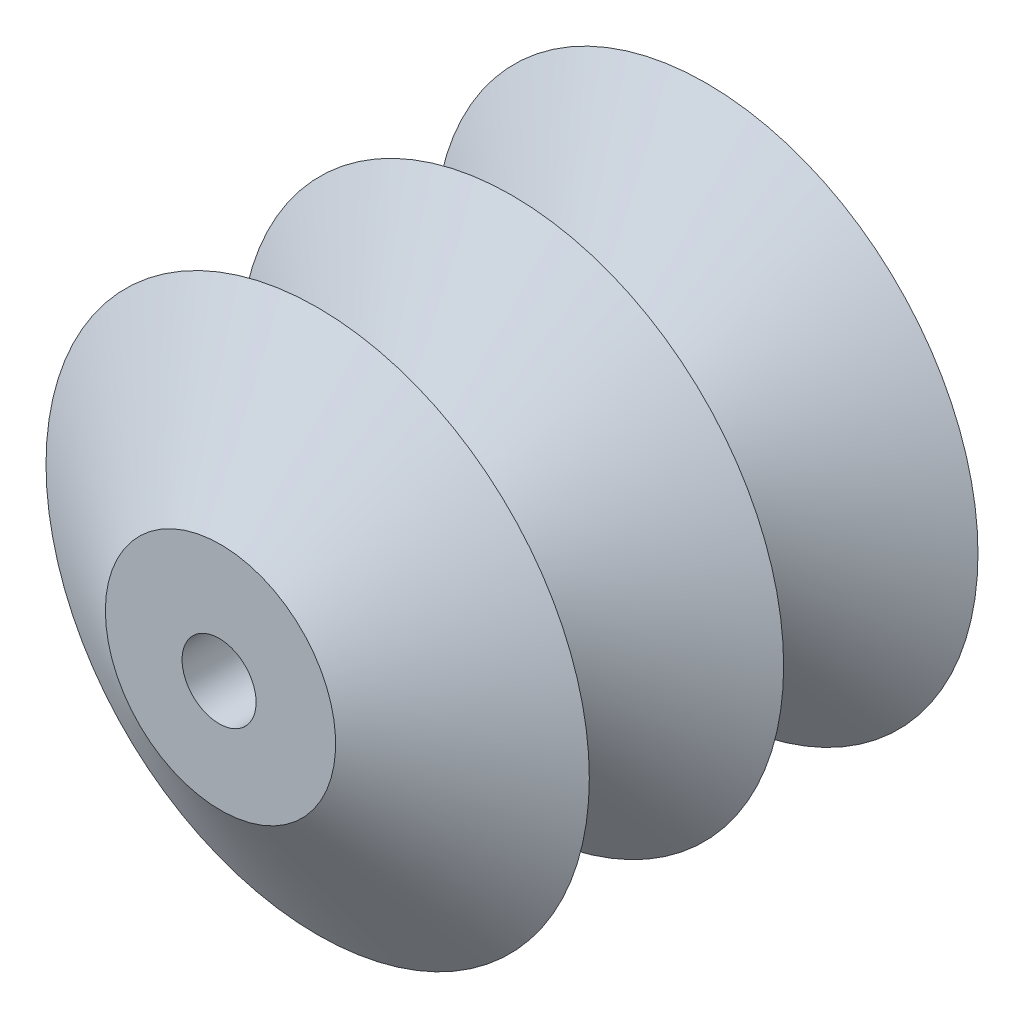
ISO-10303-21;
HEADER;
FILE_DESCRIPTION(('STEP AP214'),'2;1');
FILE_NAME('part.step','',(''),(''),'','','');
FILE_SCHEMA(('AUTOMOTIVE_DESIGN { 1 0 10303 214 1 1 1 1 }'));
ENDSEC;
DATA;
#1=APPLICATION_CONTEXT('core data for automotive mechanical design processes');
#2=APPLICATION_PROTOCOL_DEFINITION('international standard','automotive_design',2000,#1);
#3=PRODUCT_CONTEXT('',#1,'mechanical');
#4=PRODUCT('Part','Part','',(#3));
#5=PRODUCT_RELATED_PRODUCT_CATEGORY('part','',(#4));
#6=PRODUCT_DEFINITION_FORMATION('','',#4);
#7=PRODUCT_DEFINITION_CONTEXT('part definition',#1,'design');
#8=PRODUCT_DEFINITION('design','',#6,#7);
#9=PRODUCT_DEFINITION_SHAPE('','',#8);
#10=(LENGTH_UNIT() NAMED_UNIT(*) SI_UNIT(.MILLI.,.METRE.));
#11=(NAMED_UNIT(*) PLANE_ANGLE_UNIT() SI_UNIT($,.RADIAN.));
#12=(NAMED_UNIT(*) SI_UNIT($,.STERADIAN.) SOLID_ANGLE_UNIT());
#13=UNCERTAINTY_MEASURE_WITH_UNIT(LENGTH_MEASURE(1.E-05),#10,'distance_accuracy_value','');
#14=(GEOMETRIC_REPRESENTATION_CONTEXT(3) GLOBAL_UNCERTAINTY_ASSIGNED_CONTEXT((#13)) GLOBAL_UNIT_ASSIGNED_CONTEXT((#10,
#11,#12)) REPRESENTATION_CONTEXT('',''));
#15=CARTESIAN_POINT('',(0.,0.,0.));
#16=DIRECTION('',(0.,0.,1.));
#17=DIRECTION('',(1.,0.,0.));
#18=AXIS2_PLACEMENT_3D('',#15,#16,#17);
#19=CARTESIAN_POINT('',(0.,0.,35.4441396376704));
#20=DIRECTION('',(0.,0.,-1.));
#21=DIRECTION('',(-1.,0.,0.));
#22=AXIS2_PLACEMENT_3D('',#19,#20,#21);
#23=CONICAL_SURFACE('',#22,14.,1.01522411260172);
#24=CARTESIAN_POINT('',(0.,0.,23.6294264251136));
#25=DIRECTION('',(0.,0.,-1.));
#26=DIRECTION('',(-1.,0.,0.));
#27=AXIS2_PLACEMENT_3D('',#24,#25,#26);
#28=CIRCLE('',#27,33.0314822175808);
#29=CARTESIAN_POINT('',(-33.0314822175808,0.,23.6294264251136));
#30=VERTEX_POINT('',#29);
#31=EDGE_CURVE('E10',#30,#30,#28,.T.);
#32=ORIENTED_EDGE('',*,*,#31,.F.);
#33=EDGE_LOOP('',(#32));
#34=FACE_BOUND('',#33,.T.);
#35=CARTESIAN_POINT('',(0.,0.,35.4441396376704));
#36=DIRECTION('',(0.,0.,-1.));
#37=DIRECTION('',(-1.,0.,0.));
#38=AXIS2_PLACEMENT_3D('',#35,#36,#37);
#39=CIRCLE('',#38,14.);
#40=CARTESIAN_POINT('',(-14.,0.,35.4441396376704));
#41=VERTEX_POINT('',#40);
#42=EDGE_CURVE('E56',#41,#41,#39,.T.);
#43=ORIENTED_EDGE('',*,*,#42,.T.);
#44=EDGE_LOOP('',(#43));
#45=FACE_BOUND('',#44,.T.);
#46=ADVANCED_FACE('F31',(#34,#45),#23,.T.);
#47=CARTESIAN_POINT('',(0.,0.,23.6294264251136));
#48=DIRECTION('',(0.,0.,1.));
#49=DIRECTION('',(1.,0.,0.));
#50=AXIS2_PLACEMENT_3D('',#47,#48,#49);
#51=CONICAL_SURFACE('',#50,33.0314822175808,1.01522411260173);
#52=CARTESIAN_POINT('',(0.,0.,11.8147132125568));
#53=DIRECTION('',(0.,0.,-1.));
#54=DIRECTION('',(-1.,0.,0.));
#55=AXIS2_PLACEMENT_3D('',#52,#53,#54);
#56=CIRCLE('',#55,14.);
#57=CARTESIAN_POINT('',(-14.,0.,11.8147132125568));
#58=VERTEX_POINT('',#57);
#59=EDGE_CURVE('E37',#58,#58,#56,.T.);
#60=ORIENTED_EDGE('',*,*,#59,.F.);
#61=EDGE_LOOP('',(#60));
#62=FACE_BOUND('',#61,.T.);
#63=ORIENTED_EDGE('',*,*,#31,.T.);
#64=EDGE_LOOP('',(#63));
#65=FACE_BOUND('',#64,.T.);
#66=ADVANCED_FACE('F76',(#62,#65),#51,.T.);
#67=CARTESIAN_POINT('',(0.,0.,11.8147132125568));
#68=DIRECTION('',(0.,0.,-1.));
#69=DIRECTION('',(-1.,0.,0.));
#70=AXIS2_PLACEMENT_3D('',#67,#68,#69);
#71=CONICAL_SURFACE('',#70,14.,1.01522411260173);
#72=CARTESIAN_POINT('',(0.,0.,0.));
#73=DIRECTION('',(0.,0.,-1.));
#74=DIRECTION('',(-1.,0.,0.));
#75=AXIS2_PLACEMENT_3D('',#72,#73,#74);
#76=CIRCLE('',#75,33.0314822175808);
#77=CARTESIAN_POINT('',(-33.0314822175808,0.,0.));
#78=VERTEX_POINT('',#77);
#79=EDGE_CURVE('E41',#78,#78,#76,.T.);
#80=ORIENTED_EDGE('',*,*,#79,.F.);
#81=EDGE_LOOP('',(#80));
#82=FACE_BOUND('',#81,.T.);
#83=ORIENTED_EDGE('',*,*,#59,.T.);
#84=EDGE_LOOP('',(#83));
#85=FACE_BOUND('',#84,.T.);
#86=ADVANCED_FACE('F81',(#82,#85),#71,.T.);
#87=CARTESIAN_POINT('',(0.,0.,0.));
#88=DIRECTION('',(0.,0.,1.));
#89=DIRECTION('',(1.,0.,0.));
#90=AXIS2_PLACEMENT_3D('',#87,#88,#89);
#91=CONICAL_SURFACE('',#90,33.0314822175808,1.01522411260173);
#92=CARTESIAN_POINT('',(0.,0.,-11.8147132125568));
#93=DIRECTION('',(0.,0.,-1.));
#94=DIRECTION('',(-1.,0.,0.));
#95=AXIS2_PLACEMENT_3D('',#92,#93,#94);
#96=CIRCLE('',#95,14.);
#97=CARTESIAN_POINT('',(-14.,0.,-11.8147132125568));
#98=VERTEX_POINT('',#97);
#99=EDGE_CURVE('E45',#98,#98,#96,.T.);
#100=ORIENTED_EDGE('',*,*,#99,.F.);
#101=EDGE_LOOP('',(#100));
#102=FACE_BOUND('',#101,.T.);
#103=ORIENTED_EDGE('',*,*,#79,.T.);
#104=EDGE_LOOP('',(#103));
#105=FACE_BOUND('',#104,.T.);
#106=ADVANCED_FACE('F86',(#102,#105),#91,.T.);
#107=CARTESIAN_POINT('',(0.,0.,-11.8147132125568));
#108=DIRECTION('',(0.,0.,-1.));
#109=DIRECTION('',(-1.,0.,0.));
#110=AXIS2_PLACEMENT_3D('',#107,#108,#109);
#111=CONICAL_SURFACE('',#110,14.,1.01522411260173);
#112=CARTESIAN_POINT('',(0.,0.,-23.6294264251136));
#113=DIRECTION('',(0.,0.,-1.));
#114=DIRECTION('',(-1.,0.,0.));
#115=AXIS2_PLACEMENT_3D('',#112,#113,#114);
#116=CIRCLE('',#115,33.0314822175808);
#117=CARTESIAN_POINT('',(-33.0314822175808,0.,-23.6294264251136));
#118=VERTEX_POINT('',#117);
#119=EDGE_CURVE('E50',#118,#118,#116,.T.);
#120=ORIENTED_EDGE('',*,*,#119,.F.);
#121=EDGE_LOOP('',(#120));
#122=FACE_BOUND('',#121,.T.);
#123=ORIENTED_EDGE('',*,*,#99,.T.);
#124=EDGE_LOOP('',(#123));
#125=FACE_BOUND('',#124,.T.);
#126=ADVANCED_FACE('F92',(#122,#125),#111,.T.);
#127=CARTESIAN_POINT('',(0.,0.,-23.6294264251136));
#128=DIRECTION('',(0.,0.,1.));
#129=DIRECTION('',(1.,0.,0.));
#130=AXIS2_PLACEMENT_3D('',#127,#128,#129);
#131=CONICAL_SURFACE('',#130,33.0314822175808,1.01522411260172);
#132=CARTESIAN_POINT('',(0.,0.,-35.4441396376704));
#133=DIRECTION('',(0.,0.,-1.));
#134=DIRECTION('',(-1.,0.,0.));
#135=AXIS2_PLACEMENT_3D('',#132,#133,#134);
#136=CIRCLE('',#135,14.);
#137=CARTESIAN_POINT('',(-14.,0.,-35.4441396376704));
#138=VERTEX_POINT('',#137);
#139=EDGE_CURVE('E53',#138,#138,#136,.T.);
#140=ORIENTED_EDGE('',*,*,#139,.F.);
#141=EDGE_LOOP('',(#140));
#142=FACE_BOUND('',#141,.T.);
#143=ORIENTED_EDGE('',*,*,#119,.T.);
#144=EDGE_LOOP('',(#143));
#145=FACE_BOUND('',#144,.T.);
#146=ADVANCED_FACE('F96',(#142,#145),#131,.T.);
#147=CARTESIAN_POINT('',(0.,0.,-35.4441396376704));
#148=DIRECTION('',(0.,0.,1.));
#149=DIRECTION('',(1.,0.,0.));
#150=AXIS2_PLACEMENT_3D('',#147,#148,#149);
#151=PLANE('',#150);
#152=CARTESIAN_POINT('',(-0.173045488587376,-0.475875093615028,-35.4441396376704));
#153=DIRECTION('',(0.,0.,1.));
#154=DIRECTION('',(1.,0.,0.));
#155=AXIS2_PLACEMENT_3D('',#152,#153,#154);
#156=CIRCLE('',#155,4.49999999999999);
#157=CARTESIAN_POINT('',(4.32695451141262,-0.475875093615028,-35.4441396376704));
#158=VERTEX_POINT('',#157);
#159=EDGE_CURVE('E59',#158,#158,#156,.T.);
#160=ORIENTED_EDGE('',*,*,#159,.T.);
#161=EDGE_LOOP('',(#160));
#162=FACE_BOUND('',#161,.T.);
#163=ORIENTED_EDGE('',*,*,#139,.T.);
#164=EDGE_LOOP('',(#163));
#165=FACE_BOUND('',#164,.T.);
#166=ADVANCED_FACE('F71',(#162,#165),#151,.F.);
#167=CARTESIAN_POINT('',(0.,0.,35.4441396376704));
#168=DIRECTION('',(0.,0.,-1.));
#169=DIRECTION('',(-1.,0.,0.));
#170=AXIS2_PLACEMENT_3D('',#167,#168,#169);
#171=PLANE('',#170);
#172=CARTESIAN_POINT('',(-0.173045488587376,-0.475875093615028,35.4441396376704));
#173=DIRECTION('',(0.,0.,1.));
#174=DIRECTION('',(1.,0.,0.));
#175=AXIS2_PLACEMENT_3D('',#172,#173,#174);
#176=CIRCLE('',#175,4.49999999999999);
#177=CARTESIAN_POINT('',(4.32695451141261,-0.475875093615028,35.4441396376704));
#178=VERTEX_POINT('',#177);
#179=EDGE_CURVE('E62',#178,#178,#176,.T.);
#180=ORIENTED_EDGE('',*,*,#179,.F.);
#181=EDGE_LOOP('',(#180));
#182=FACE_BOUND('',#181,.T.);
#183=ORIENTED_EDGE('',*,*,#42,.F.);
#184=EDGE_LOOP('',(#183));
#185=FACE_BOUND('',#184,.T.);
#186=ADVANCED_FACE('F68',(#182,#185),#171,.F.);
#187=CARTESIAN_POINT('',(-0.173045488587376,-0.475875093615028,35.4441396376704));
#188=DIRECTION('',(0.,0.,1.));
#189=DIRECTION('',(1.,0.,0.));
#190=AXIS2_PLACEMENT_3D('',#187,#188,#189);
#191=CYLINDRICAL_SURFACE('',#190,4.49999999999999);
#192=ORIENTED_EDGE('',*,*,#159,.F.);
#193=EDGE_LOOP('',(#192));
#194=FACE_BOUND('',#193,.T.);
#195=ORIENTED_EDGE('',*,*,#179,.T.);
#196=EDGE_LOOP('',(#195));
#197=FACE_BOUND('',#196,.T.);
#198=ADVANCED_FACE('F66',(#194,#197),#191,.F.);
#199=CLOSED_SHELL('',(#46,#66,#86,#106,#126,#146,#166,#186,#198));
#200=MANIFOLD_SOLID_BREP('B2',#199);
#201=ADVANCED_BREP_SHAPE_REPRESENTATION('',(#18,#200),#14);
#202=SHAPE_DEFINITION_REPRESENTATION(#9,#201);
ENDSEC;
END-ISO-10303-21;
